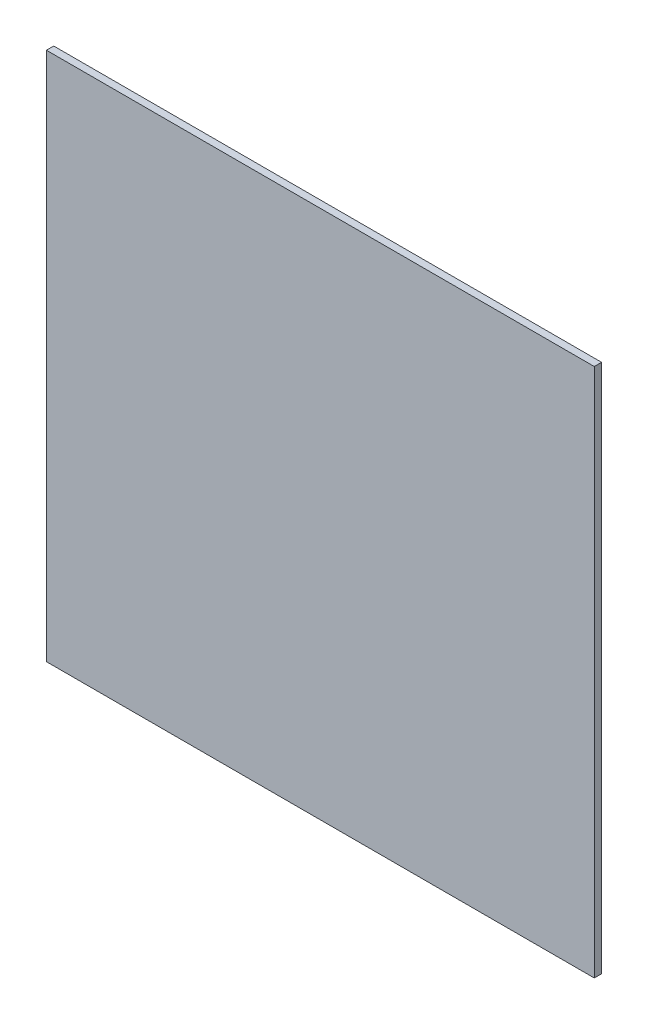
ISO-10303-21;
HEADER;
FILE_DESCRIPTION(('STEP AP214'),'2;1');
FILE_NAME('part.step','',(''),(''),'','','');
FILE_SCHEMA(('AUTOMOTIVE_DESIGN { 1 0 10303 214 1 1 1 1 }'));
ENDSEC;
DATA;
#1=APPLICATION_CONTEXT('core data for automotive mechanical design processes');
#2=APPLICATION_PROTOCOL_DEFINITION('international standard','automotive_design',2000,#1);
#3=PRODUCT_CONTEXT('',#1,'mechanical');
#4=PRODUCT('Part','Part','',(#3));
#5=PRODUCT_RELATED_PRODUCT_CATEGORY('part','',(#4));
#6=PRODUCT_DEFINITION_FORMATION('','',#4);
#7=PRODUCT_DEFINITION_CONTEXT('part definition',#1,'design');
#8=PRODUCT_DEFINITION('design','',#6,#7);
#9=PRODUCT_DEFINITION_SHAPE('','',#8);
#10=(LENGTH_UNIT() NAMED_UNIT(*) SI_UNIT(.MILLI.,.METRE.));
#11=(NAMED_UNIT(*) PLANE_ANGLE_UNIT() SI_UNIT($,.RADIAN.));
#12=(NAMED_UNIT(*) SI_UNIT($,.STERADIAN.) SOLID_ANGLE_UNIT());
#13=UNCERTAINTY_MEASURE_WITH_UNIT(LENGTH_MEASURE(1.E-05),#10,'distance_accuracy_value','');
#14=(GEOMETRIC_REPRESENTATION_CONTEXT(3) GLOBAL_UNCERTAINTY_ASSIGNED_CONTEXT((#13)) GLOBAL_UNIT_ASSIGNED_CONTEXT((#10,
#11,#12)) REPRESENTATION_CONTEXT('',''));
#15=CARTESIAN_POINT('',(0.,0.,0.));
#16=DIRECTION('',(0.,0.,1.));
#17=DIRECTION('',(1.,0.,0.));
#18=AXIS2_PLACEMENT_3D('',#15,#16,#17);
#19=CARTESIAN_POINT('',(0.,0.,4.));
#20=DIRECTION('',(1.,0.,0.));
#21=DIRECTION('',(0.,0.,-1.));
#22=AXIS2_PLACEMENT_3D('',#19,#20,#21);
#23=PLANE('',#22);
#24=CARTESIAN_POINT('',(0.,45.,2.00000000000033));
#25=DIRECTION('',(-1.,0.,0.));
#26=DIRECTION('',(0.,0.,-1.));
#27=AXIS2_PLACEMENT_3D('',#24,#25,#26);
#28=CIRCLE('',#27,1.5);
#29=CARTESIAN_POINT('',(0.,45.,0.500000000000329));
#30=VERTEX_POINT('',#29);
#31=EDGE_CURVE('E142',#30,#30,#28,.T.);
#32=ORIENTED_EDGE('',*,*,#31,.F.);
#33=EDGE_LOOP('',(#32));
#34=FACE_BOUND('',#33,.T.);
#35=CARTESIAN_POINT('',(0.,145.,2.));
#36=DIRECTION('',(-1.,0.,0.));
#37=DIRECTION('',(0.,0.,1.));
#38=AXIS2_PLACEMENT_3D('',#35,#36,#37);
#39=CIRCLE('',#38,1.5);
#40=CARTESIAN_POINT('',(0.,145.,3.5));
#41=VERTEX_POINT('',#40);
#42=EDGE_CURVE('E136',#41,#41,#39,.T.);
#43=ORIENTED_EDGE('',*,*,#42,.F.);
#44=EDGE_LOOP('',(#43));
#45=FACE_BOUND('',#44,.T.);
#46=CARTESIAN_POINT('',(0.,245.,2.));
#47=DIRECTION('',(-1.,0.,0.));
#48=DIRECTION('',(0.,0.,1.));
#49=AXIS2_PLACEMENT_3D('',#46,#47,#48);
#50=CIRCLE('',#49,1.5);
#51=CARTESIAN_POINT('',(0.,245.,3.5));
#52=VERTEX_POINT('',#51);
#53=EDGE_CURVE('E130',#52,#52,#50,.T.);
#54=ORIENTED_EDGE('',*,*,#53,.F.);
#55=EDGE_LOOP('',(#54));
#56=FACE_BOUND('',#55,.T.);
#57=DIRECTION('',(0.,-1.,0.));
#58=VECTOR('',#57,1.);
#59=CARTESIAN_POINT('',(0.,0.,4.));
#60=LINE('',#59,#58);
#61=CARTESIAN_POINT('',(0.,290.,4.));
#62=VERTEX_POINT('',#61);
#63=CARTESIAN_POINT('',(0.,0.,4.));
#64=VERTEX_POINT('',#63);
#65=EDGE_CURVE('E96',#62,#64,#60,.T.);
#66=ORIENTED_EDGE('',*,*,#65,.F.);
#67=DIRECTION('',(0.,0.,-1.));
#68=VECTOR('',#67,1.);
#69=CARTESIAN_POINT('',(0.,290.,4.));
#70=LINE('',#69,#68);
#71=CARTESIAN_POINT('',(0.,290.,0.));
#72=VERTEX_POINT('',#71);
#73=EDGE_CURVE('E114',#62,#72,#70,.T.);
#74=ORIENTED_EDGE('',*,*,#73,.T.);
#75=DIRECTION('',(0.,-1.,0.));
#76=VECTOR('',#75,1.);
#77=CARTESIAN_POINT('',(0.,0.,0.));
#78=LINE('',#77,#76);
#79=CARTESIAN_POINT('',(0.,0.,0.));
#80=VERTEX_POINT('',#79);
#81=EDGE_CURVE('E88',#72,#80,#78,.T.);
#82=ORIENTED_EDGE('',*,*,#81,.T.);
#83=DIRECTION('',(0.,0.,-1.));
#84=VECTOR('',#83,1.);
#85=CARTESIAN_POINT('',(0.,0.,4.));
#86=LINE('',#85,#84);
#87=EDGE_CURVE('E13',#64,#80,#86,.T.);
#88=ORIENTED_EDGE('',*,*,#87,.F.);
#89=EDGE_LOOP('',(#66,#74,#82,#88));
#90=FACE_BOUND('',#89,.T.);
#91=ADVANCED_FACE('F44',(#34,#45,#56,#90),#23,.F.);
#92=CARTESIAN_POINT('',(0.,0.,4.));
#93=DIRECTION('',(0.,1.,0.));
#94=DIRECTION('',(0.,0.,1.));
#95=AXIS2_PLACEMENT_3D('',#92,#93,#94);
#96=PLANE('',#95);
#97=CARTESIAN_POINT('',(250.,0.,2.));
#98=DIRECTION('',(0.,-1.,0.));
#99=DIRECTION('',(0.,0.,1.));
#100=AXIS2_PLACEMENT_3D('',#97,#98,#99);
#101=CIRCLE('',#100,1.49999999999997);
#102=CARTESIAN_POINT('',(250.,0.,3.49999999999997));
#103=VERTEX_POINT('',#102);
#104=EDGE_CURVE('E117',#103,#103,#101,.T.);
#105=ORIENTED_EDGE('',*,*,#104,.F.);
#106=EDGE_LOOP('',(#105));
#107=FACE_BOUND('',#106,.T.);
#108=CARTESIAN_POINT('',(150.,0.,2.));
#109=DIRECTION('',(0.,-1.,0.));
#110=DIRECTION('',(0.,0.,-1.));
#111=AXIS2_PLACEMENT_3D('',#108,#109,#110);
#112=CIRCLE('',#111,1.5);
#113=CARTESIAN_POINT('',(150.,0.,0.500000000000003));
#114=VERTEX_POINT('',#113);
#115=EDGE_CURVE('E110',#114,#114,#112,.T.);
#116=ORIENTED_EDGE('',*,*,#115,.F.);
#117=EDGE_LOOP('',(#116));
#118=FACE_BOUND('',#117,.T.);
#119=CARTESIAN_POINT('',(50.,0.,2.));
#120=DIRECTION('',(0.,-1.,0.));
#121=DIRECTION('',(0.,0.,-1.));
#122=AXIS2_PLACEMENT_3D('',#119,#120,#121);
#123=CIRCLE('',#122,1.5);
#124=CARTESIAN_POINT('',(50.,0.,0.499999999999996));
#125=VERTEX_POINT('',#124);
#126=EDGE_CURVE('E104',#125,#125,#123,.T.);
#127=ORIENTED_EDGE('',*,*,#126,.F.);
#128=EDGE_LOOP('',(#127));
#129=FACE_BOUND('',#128,.T.);
#130=DIRECTION('',(1.,0.,0.));
#131=VECTOR('',#130,1.);
#132=CARTESIAN_POINT('',(0.,0.,0.));
#133=LINE('',#132,#131);
#134=CARTESIAN_POINT('',(300.,0.,0.));
#135=VERTEX_POINT('',#134);
#136=EDGE_CURVE('E79',#80,#135,#133,.T.);
#137=ORIENTED_EDGE('',*,*,#136,.T.);
#138=DIRECTION('',(0.,0.,-1.));
#139=VECTOR('',#138,1.);
#140=CARTESIAN_POINT('',(300.,0.,4.));
#141=LINE('',#140,#139);
#142=CARTESIAN_POINT('',(300.,0.,4.));
#143=VERTEX_POINT('',#142);
#144=EDGE_CURVE('E51',#143,#135,#141,.T.);
#145=ORIENTED_EDGE('',*,*,#144,.F.);
#146=DIRECTION('',(1.,0.,0.));
#147=VECTOR('',#146,1.);
#148=CARTESIAN_POINT('',(0.,0.,4.));
#149=LINE('',#148,#147);
#150=EDGE_CURVE('E67',#64,#143,#149,.T.);
#151=ORIENTED_EDGE('',*,*,#150,.F.);
#152=ORIENTED_EDGE('',*,*,#87,.T.);
#153=EDGE_LOOP('',(#137,#145,#151,#152));
#154=FACE_BOUND('',#153,.T.);
#155=ADVANCED_FACE('F81',(#107,#118,#129,#154),#96,.F.);
#156=CARTESIAN_POINT('',(300.,0.,4.));
#157=DIRECTION('',(-1.,0.,0.));
#158=DIRECTION('',(0.,0.,1.));
#159=AXIS2_PLACEMENT_3D('',#156,#157,#158);
#160=PLANE('',#159);
#161=DIRECTION('',(0.,1.,0.));
#162=VECTOR('',#161,1.);
#163=CARTESIAN_POINT('',(300.,0.,0.));
#164=LINE('',#163,#162);
#165=CARTESIAN_POINT('',(300.,290.,0.));
#166=VERTEX_POINT('',#165);
#167=EDGE_CURVE('E87',#135,#166,#164,.T.);
#168=ORIENTED_EDGE('',*,*,#167,.T.);
#169=DIRECTION('',(0.,0.,-1.));
#170=VECTOR('',#169,1.);
#171=CARTESIAN_POINT('',(300.,290.,4.));
#172=LINE('',#171,#170);
#173=CARTESIAN_POINT('',(300.,290.,4.));
#174=VERTEX_POINT('',#173);
#175=EDGE_CURVE('E58',#174,#166,#172,.T.);
#176=ORIENTED_EDGE('',*,*,#175,.F.);
#177=DIRECTION('',(0.,1.,0.));
#178=VECTOR('',#177,1.);
#179=CARTESIAN_POINT('',(300.,0.,4.));
#180=LINE('',#179,#178);
#181=EDGE_CURVE('E93',#143,#174,#180,.T.);
#182=ORIENTED_EDGE('',*,*,#181,.F.);
#183=ORIENTED_EDGE('',*,*,#144,.T.);
#184=EDGE_LOOP('',(#168,#176,#182,#183));
#185=FACE_BOUND('',#184,.T.);
#186=ADVANCED_FACE('F92',(#185),#160,.F.);
#187=CARTESIAN_POINT('',(0.,0.,4.));
#188=DIRECTION('',(0.,0.,-1.));
#189=DIRECTION('',(-1.,0.,0.));
#190=AXIS2_PLACEMENT_3D('',#187,#188,#189);
#191=PLANE('',#190);
#192=ORIENTED_EDGE('',*,*,#181,.T.);
#193=DIRECTION('',(-1.,0.,0.));
#194=VECTOR('',#193,1.);
#195=CARTESIAN_POINT('',(0.,290.,4.));
#196=LINE('',#195,#194);
#197=EDGE_CURVE('E123',#174,#62,#196,.T.);
#198=ORIENTED_EDGE('',*,*,#197,.T.);
#199=ORIENTED_EDGE('',*,*,#65,.T.);
#200=ORIENTED_EDGE('',*,*,#150,.T.);
#201=EDGE_LOOP('',(#192,#198,#199,#200));
#202=FACE_BOUND('',#201,.T.);
#203=ADVANCED_FACE('F168',(#202),#191,.F.);
#204=CARTESIAN_POINT('',(0.,0.,0.));
#205=DIRECTION('',(0.,0.,-1.));
#206=DIRECTION('',(-1.,0.,0.));
#207=AXIS2_PLACEMENT_3D('',#204,#205,#206);
#208=PLANE('',#207);
#209=DIRECTION('',(-1.,0.,0.));
#210=VECTOR('',#209,1.);
#211=CARTESIAN_POINT('',(0.,290.,0.));
#212=LINE('',#211,#210);
#213=EDGE_CURVE('E95',#166,#72,#212,.T.);
#214=ORIENTED_EDGE('',*,*,#213,.F.);
#215=ORIENTED_EDGE('',*,*,#167,.F.);
#216=ORIENTED_EDGE('',*,*,#136,.F.);
#217=ORIENTED_EDGE('',*,*,#81,.F.);
#218=EDGE_LOOP('',(#214,#215,#216,#217));
#219=FACE_BOUND('',#218,.T.);
#220=ADVANCED_FACE('F94',(#219),#208,.T.);
#221=CARTESIAN_POINT('',(50.,25.,2.));
#222=DIRECTION('',(0.,-1.,0.));
#223=DIRECTION('',(0.,0.,-1.));
#224=AXIS2_PLACEMENT_3D('',#221,#222,#223);
#225=CYLINDRICAL_SURFACE('',#224,1.5);
#226=CARTESIAN_POINT('',(50.,25.,2.));
#227=DIRECTION('',(0.,-1.,0.));
#228=DIRECTION('',(0.,0.,-1.));
#229=AXIS2_PLACEMENT_3D('',#226,#227,#228);
#230=CIRCLE('',#229,1.5);
#231=CARTESIAN_POINT('',(50.,25.,0.499999999999996));
#232=VERTEX_POINT('',#231);
#233=EDGE_CURVE('E101',#232,#232,#230,.T.);
#234=ORIENTED_EDGE('',*,*,#233,.F.);
#235=EDGE_LOOP('',(#234));
#236=FACE_BOUND('',#235,.T.);
#237=ORIENTED_EDGE('',*,*,#126,.T.);
#238=EDGE_LOOP('',(#237));
#239=FACE_BOUND('',#238,.T.);
#240=ADVANCED_FACE('F201',(#236,#239),#225,.F.);
#241=CARTESIAN_POINT('',(50.,25.,2.));
#242=DIRECTION('',(0.,-1.,0.));
#243=DIRECTION('',(0.,0.,-1.));
#244=AXIS2_PLACEMENT_3D('',#241,#242,#243);
#245=PLANE('',#244);
#246=ORIENTED_EDGE('',*,*,#233,.T.);
#247=EDGE_LOOP('',(#246));
#248=FACE_BOUND('',#247,.T.);
#249=ADVANCED_FACE('F197',(#248),#245,.T.);
#250=CARTESIAN_POINT('',(150.,25.,2.));
#251=DIRECTION('',(0.,-1.,0.));
#252=DIRECTION('',(0.,0.,-1.));
#253=AXIS2_PLACEMENT_3D('',#250,#251,#252);
#254=CYLINDRICAL_SURFACE('',#253,1.5);
#255=CARTESIAN_POINT('',(150.,25.,2.));
#256=DIRECTION('',(0.,-1.,0.));
#257=DIRECTION('',(0.,0.,-1.));
#258=AXIS2_PLACEMENT_3D('',#255,#256,#257);
#259=CIRCLE('',#258,1.5);
#260=CARTESIAN_POINT('',(150.,25.,0.500000000000003));
#261=VERTEX_POINT('',#260);
#262=EDGE_CURVE('E113',#261,#261,#259,.T.);
#263=ORIENTED_EDGE('',*,*,#262,.F.);
#264=EDGE_LOOP('',(#263));
#265=FACE_BOUND('',#264,.T.);
#266=ORIENTED_EDGE('',*,*,#115,.T.);
#267=EDGE_LOOP('',(#266));
#268=FACE_BOUND('',#267,.T.);
#269=ADVANCED_FACE('F193',(#265,#268),#254,.F.);
#270=CARTESIAN_POINT('',(150.,25.,2.));
#271=DIRECTION('',(0.,-1.,0.));
#272=DIRECTION('',(0.,0.,-1.));
#273=AXIS2_PLACEMENT_3D('',#270,#271,#272);
#274=PLANE('',#273);
#275=ORIENTED_EDGE('',*,*,#262,.T.);
#276=EDGE_LOOP('',(#275));
#277=FACE_BOUND('',#276,.T.);
#278=ADVANCED_FACE('F189',(#277),#274,.T.);
#279=CARTESIAN_POINT('',(250.,25.,2.));
#280=DIRECTION('',(0.,-1.,0.));
#281=DIRECTION('',(0.,0.,-1.));
#282=AXIS2_PLACEMENT_3D('',#279,#280,#281);
#283=CYLINDRICAL_SURFACE('',#282,1.49999999999997);
#284=CARTESIAN_POINT('',(250.,25.,2.));
#285=DIRECTION('',(0.,-1.,0.));
#286=DIRECTION('',(0.,0.,1.));
#287=AXIS2_PLACEMENT_3D('',#284,#285,#286);
#288=CIRCLE('',#287,1.49999999999997);
#289=CARTESIAN_POINT('',(250.,25.,3.49999999999997));
#290=VERTEX_POINT('',#289);
#291=EDGE_CURVE('E107',#290,#290,#288,.T.);
#292=ORIENTED_EDGE('',*,*,#291,.F.);
#293=EDGE_LOOP('',(#292));
#294=FACE_BOUND('',#293,.T.);
#295=ORIENTED_EDGE('',*,*,#104,.T.);
#296=EDGE_LOOP('',(#295));
#297=FACE_BOUND('',#296,.T.);
#298=ADVANCED_FACE('F182',(#294,#297),#283,.F.);
#299=CARTESIAN_POINT('',(250.,25.,2.));
#300=DIRECTION('',(0.,1.,0.));
#301=DIRECTION('',(0.,0.,1.));
#302=AXIS2_PLACEMENT_3D('',#299,#300,#301);
#303=PLANE('',#302);
#304=ORIENTED_EDGE('',*,*,#291,.T.);
#305=EDGE_LOOP('',(#304));
#306=FACE_BOUND('',#305,.T.);
#307=ADVANCED_FACE('F173',(#306),#303,.F.);
#308=CARTESIAN_POINT('',(0.,290.,4.));
#309=DIRECTION('',(0.,-1.,0.));
#310=DIRECTION('',(1.,0.,0.));
#311=AXIS2_PLACEMENT_3D('',#308,#309,#310);
#312=PLANE('',#311);
#313=ORIENTED_EDGE('',*,*,#213,.T.);
#314=ORIENTED_EDGE('',*,*,#73,.F.);
#315=ORIENTED_EDGE('',*,*,#197,.F.);
#316=ORIENTED_EDGE('',*,*,#175,.T.);
#317=EDGE_LOOP('',(#313,#314,#315,#316));
#318=FACE_BOUND('',#317,.T.);
#319=ADVANCED_FACE('F169',(#318),#312,.F.);
#320=CARTESIAN_POINT('',(25.,245.,2.));
#321=DIRECTION('',(-1.,0.,0.));
#322=DIRECTION('',(0.,0.,1.));
#323=AXIS2_PLACEMENT_3D('',#320,#321,#322);
#324=CYLINDRICAL_SURFACE('',#323,1.5);
#325=CARTESIAN_POINT('',(25.,245.,2.));
#326=DIRECTION('',(-1.,0.,0.));
#327=DIRECTION('',(0.,0.,1.));
#328=AXIS2_PLACEMENT_3D('',#325,#326,#327);
#329=CIRCLE('',#328,1.5);
#330=CARTESIAN_POINT('',(25.,245.,3.5));
#331=VERTEX_POINT('',#330);
#332=EDGE_CURVE('E127',#331,#331,#329,.T.);
#333=ORIENTED_EDGE('',*,*,#332,.F.);
#334=EDGE_LOOP('',(#333));
#335=FACE_BOUND('',#334,.T.);
#336=ORIENTED_EDGE('',*,*,#53,.T.);
#337=EDGE_LOOP('',(#336));
#338=FACE_BOUND('',#337,.T.);
#339=ADVANCED_FACE('F172',(#335,#338),#324,.F.);
#340=CARTESIAN_POINT('',(25.,245.,2.));
#341=DIRECTION('',(-1.,0.,0.));
#342=DIRECTION('',(0.,0.,1.));
#343=AXIS2_PLACEMENT_3D('',#340,#341,#342);
#344=PLANE('',#343);
#345=ORIENTED_EDGE('',*,*,#332,.T.);
#346=EDGE_LOOP('',(#345));
#347=FACE_BOUND('',#346,.T.);
#348=ADVANCED_FACE('F179',(#347),#344,.T.);
#349=CARTESIAN_POINT('',(25.,145.,2.));
#350=DIRECTION('',(-1.,0.,0.));
#351=DIRECTION('',(0.,0.,1.));
#352=AXIS2_PLACEMENT_3D('',#349,#350,#351);
#353=CYLINDRICAL_SURFACE('',#352,1.5);
#354=CARTESIAN_POINT('',(25.,145.,2.));
#355=DIRECTION('',(-1.,0.,0.));
#356=DIRECTION('',(0.,0.,1.));
#357=AXIS2_PLACEMENT_3D('',#354,#355,#356);
#358=CIRCLE('',#357,1.5);
#359=CARTESIAN_POINT('',(25.,145.,3.5));
#360=VERTEX_POINT('',#359);
#361=EDGE_CURVE('E139',#360,#360,#358,.T.);
#362=ORIENTED_EDGE('',*,*,#361,.F.);
#363=EDGE_LOOP('',(#362));
#364=FACE_BOUND('',#363,.T.);
#365=ORIENTED_EDGE('',*,*,#42,.T.);
#366=EDGE_LOOP('',(#365));
#367=FACE_BOUND('',#366,.T.);
#368=ADVANCED_FACE('F292',(#364,#367),#353,.F.);
#369=CARTESIAN_POINT('',(25.,145.,2.));
#370=DIRECTION('',(-1.,0.,0.));
#371=DIRECTION('',(0.,0.,1.));
#372=AXIS2_PLACEMENT_3D('',#369,#370,#371);
#373=PLANE('',#372);
#374=ORIENTED_EDGE('',*,*,#361,.T.);
#375=EDGE_LOOP('',(#374));
#376=FACE_BOUND('',#375,.T.);
#377=ADVANCED_FACE('F153',(#376),#373,.T.);
#378=CARTESIAN_POINT('',(25.,45.,2.00000000000033));
#379=DIRECTION('',(-1.,0.,0.));
#380=DIRECTION('',(0.,0.,1.));
#381=AXIS2_PLACEMENT_3D('',#378,#379,#380);
#382=CYLINDRICAL_SURFACE('',#381,1.5);
#383=CARTESIAN_POINT('',(25.,45.,2.00000000000033));
#384=DIRECTION('',(-1.,0.,0.));
#385=DIRECTION('',(0.,0.,-1.));
#386=AXIS2_PLACEMENT_3D('',#383,#384,#385);
#387=CIRCLE('',#386,1.5);
#388=CARTESIAN_POINT('',(25.,45.,0.500000000000329));
#389=VERTEX_POINT('',#388);
#390=EDGE_CURVE('E133',#389,#389,#387,.T.);
#391=ORIENTED_EDGE('',*,*,#390,.F.);
#392=EDGE_LOOP('',(#391));
#393=FACE_BOUND('',#392,.T.);
#394=ORIENTED_EDGE('',*,*,#31,.T.);
#395=EDGE_LOOP('',(#394));
#396=FACE_BOUND('',#395,.T.);
#397=ADVANCED_FACE('F150',(#393,#396),#382,.F.);
#398=CARTESIAN_POINT('',(25.,45.,2.00000000000033));
#399=DIRECTION('',(1.,0.,0.));
#400=DIRECTION('',(0.,0.,-1.));
#401=AXIS2_PLACEMENT_3D('',#398,#399,#400);
#402=PLANE('',#401);
#403=ORIENTED_EDGE('',*,*,#390,.T.);
#404=EDGE_LOOP('',(#403));
#405=FACE_BOUND('',#404,.T.);
#406=ADVANCED_FACE('F148',(#405),#402,.F.);
#407=CLOSED_SHELL('',(#91,#155,#186,#203,#220,#240,#249,#269,#278,#298,#307,#319,#339,#348,#368,
#377,#397,#406));
#408=MANIFOLD_SOLID_BREP('B2',#407);
#409=ADVANCED_BREP_SHAPE_REPRESENTATION('',(#18,#408),#14);
#410=SHAPE_DEFINITION_REPRESENTATION(#9,#409);
ENDSEC;
END-ISO-10303-21;
